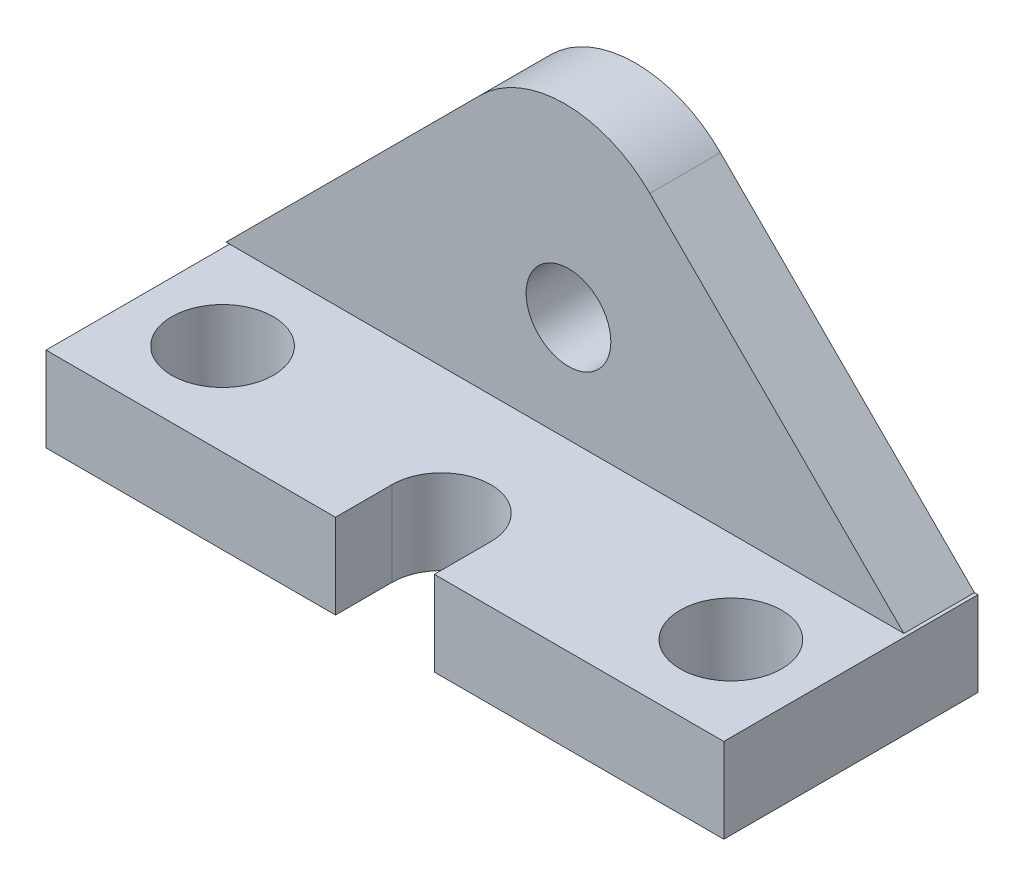
ISO-10303-21;
HEADER;
FILE_DESCRIPTION(('STEP AP214'),'2;1');
FILE_NAME('part.step','',(''),(''),'','','');
FILE_SCHEMA(('AUTOMOTIVE_DESIGN { 1 0 10303 214 1 1 1 1 }'));
ENDSEC;
DATA;
#1=APPLICATION_CONTEXT('core data for automotive mechanical design processes');
#2=APPLICATION_PROTOCOL_DEFINITION('international standard','automotive_design',2000,#1);
#3=PRODUCT_CONTEXT('',#1,'mechanical');
#4=PRODUCT('Part','Part','',(#3));
#5=PRODUCT_RELATED_PRODUCT_CATEGORY('part','',(#4));
#6=PRODUCT_DEFINITION_FORMATION('','',#4);
#7=PRODUCT_DEFINITION_CONTEXT('part definition',#1,'design');
#8=PRODUCT_DEFINITION('design','',#6,#7);
#9=PRODUCT_DEFINITION_SHAPE('','',#8);
#10=(LENGTH_UNIT() NAMED_UNIT(*) SI_UNIT(.MILLI.,.METRE.));
#11=(NAMED_UNIT(*) PLANE_ANGLE_UNIT() SI_UNIT($,.RADIAN.));
#12=(NAMED_UNIT(*) SI_UNIT($,.STERADIAN.) SOLID_ANGLE_UNIT());
#13=UNCERTAINTY_MEASURE_WITH_UNIT(LENGTH_MEASURE(1.E-05),#10,'distance_accuracy_value','');
#14=(GEOMETRIC_REPRESENTATION_CONTEXT(3) GLOBAL_UNCERTAINTY_ASSIGNED_CONTEXT((#13)) GLOBAL_UNIT_ASSIGNED_CONTEXT((#10,
#11,#12)) REPRESENTATION_CONTEXT('',''));
#15=CARTESIAN_POINT('',(0.,0.,0.));
#16=DIRECTION('',(0.,0.,1.));
#17=DIRECTION('',(1.,0.,0.));
#18=AXIS2_PLACEMENT_3D('',#15,#16,#17);
#19=CARTESIAN_POINT('',(48.,0.,31.));
#20=DIRECTION('',(0.,0.,-1.));
#21=DIRECTION('',(-1.,0.,0.));
#22=AXIS2_PLACEMENT_3D('',#19,#20,#21);
#23=PLANE('',#22);
#24=DIRECTION('',(-1.,0.,0.));
#25=VECTOR('',#24,1.);
#26=CARTESIAN_POINT('',(48.,0.,31.));
#27=LINE('',#26,#25);
#28=CARTESIAN_POINT('',(48.,0.,31.));
#29=VERTEX_POINT('',#28);
#30=CARTESIAN_POINT('',(7.,0.,31.));
#31=VERTEX_POINT('',#30);
#32=EDGE_CURVE('E168',#29,#31,#27,.T.);
#33=ORIENTED_EDGE('',*,*,#32,.T.);
#34=DIRECTION('',(0.,1.,0.));
#35=VECTOR('',#34,1.);
#36=CARTESIAN_POINT('',(7.,-48.,31.));
#37=LINE('',#36,#35);
#38=CARTESIAN_POINT('',(7.,-12.,31.));
#39=VERTEX_POINT('',#38);
#40=EDGE_CURVE('E151',#39,#31,#37,.T.);
#41=ORIENTED_EDGE('',*,*,#40,.F.);
#42=DIRECTION('',(-1.,0.,0.));
#43=VECTOR('',#42,1.);
#44=CARTESIAN_POINT('',(48.,-12.,31.));
#45=LINE('',#44,#43);
#46=CARTESIAN_POINT('',(48.,-12.,31.));
#47=VERTEX_POINT('',#46);
#48=EDGE_CURVE('E157',#47,#39,#45,.T.);
#49=ORIENTED_EDGE('',*,*,#48,.F.);
#50=DIRECTION('',(0.,-1.,0.));
#51=VECTOR('',#50,1.);
#52=CARTESIAN_POINT('',(48.,0.,31.));
#53=LINE('',#52,#51);
#54=EDGE_CURVE('E275',#29,#47,#53,.T.);
#55=ORIENTED_EDGE('',*,*,#54,.F.);
#56=EDGE_LOOP('',(#33,#41,#49,#55));
#57=FACE_BOUND('',#56,.T.);
#58=ADVANCED_FACE('F39',(#57),#23,.F.);
#59=CARTESIAN_POINT('',(-0.497409326424877,23.9583694396574,5.));
#60=DIRECTION('',(0.,0.,-1.));
#61=DIRECTION('',(-1.,0.,0.));
#62=AXIS2_PLACEMENT_3D('',#59,#60,#61);
#63=PLANE('',#62);
#64=DIRECTION('',(-0.707106781186548,-0.707106781186548,0.));
#65=VECTOR('',#64,1.);
#66=CARTESIAN_POINT('',(-48.4974093264249,0.,5.));
#67=LINE('',#66,#65);
#68=CARTESIAN_POINT('',(-12.5182246065962,35.9791847198287,5.));
#69=VERTEX_POINT('',#68);
#70=CARTESIAN_POINT('',(-48.4974093264249,0.,5.));
#71=VERTEX_POINT('',#70);
#72=EDGE_CURVE('E188',#69,#71,#67,.T.);
#73=ORIENTED_EDGE('',*,*,#72,.T.);
#74=DIRECTION('',(1.,0.,0.));
#75=VECTOR('',#74,1.);
#76=CARTESIAN_POINT('',(-48.4974093264249,0.,5.));
#77=LINE('',#76,#75);
#78=CARTESIAN_POINT('',(-48.,0.,5.));
#79=VERTEX_POINT('',#78);
#80=EDGE_CURVE('E194',#71,#79,#77,.T.);
#81=ORIENTED_EDGE('',*,*,#80,.T.);
#82=CARTESIAN_POINT('',(47.5025906735751,0.,5.));
#83=VERTEX_POINT('',#82);
#84=EDGE_CURVE('E192',#79,#83,#77,.T.);
#85=ORIENTED_EDGE('',*,*,#84,.T.);
#86=DIRECTION('',(-0.707106781186548,0.707106781186547,0.));
#87=VECTOR('',#86,1.);
#88=CARTESIAN_POINT('',(47.5025906735751,0.,5.));
#89=LINE('',#88,#87);
#90=CARTESIAN_POINT('',(11.5234059537464,35.9791847198287,5.));
#91=VERTEX_POINT('',#90);
#92=EDGE_CURVE('E198',#83,#91,#89,.T.);
#93=ORIENTED_EDGE('',*,*,#92,.T.);
#94=CARTESIAN_POINT('',(-0.497409326424877,23.9583694396574,5.));
#95=DIRECTION('',(0.,0.,1.));
#96=DIRECTION('',(-1.,0.,0.));
#97=AXIS2_PLACEMENT_3D('',#94,#95,#96);
#98=CIRCLE('',#97,17.);
#99=EDGE_CURVE('E201',#91,#69,#98,.T.);
#100=ORIENTED_EDGE('',*,*,#99,.T.);
#101=EDGE_LOOP('',(#73,#81,#85,#93,#100));
#102=FACE_BOUND('',#101,.T.);
#103=CARTESIAN_POINT('',(0.,15.,5.));
#104=DIRECTION('',(0.,0.,1.));
#105=DIRECTION('',(1.,0.,0.));
#106=AXIS2_PLACEMENT_3D('',#103,#104,#105);
#107=CIRCLE('',#106,6.);
#108=CARTESIAN_POINT('',(6.,15.,5.));
#109=VERTEX_POINT('',#108);
#110=EDGE_CURVE('E180',#109,#109,#107,.T.);
#111=ORIENTED_EDGE('',*,*,#110,.F.);
#112=EDGE_LOOP('',(#111));
#113=FACE_BOUND('',#112,.T.);
#114=ADVANCED_FACE('F307',(#102,#113),#63,.F.);
#115=CARTESIAN_POINT('',(-0.497409326424877,23.9583694396574,-5.));
#116=DIRECTION('',(0.,0.,-1.));
#117=DIRECTION('',(-1.,0.,0.));
#118=AXIS2_PLACEMENT_3D('',#115,#116,#117);
#119=PLANE('',#118);
#120=DIRECTION('',(-0.707106781186548,-0.707106781186548,0.));
#121=VECTOR('',#120,1.);
#122=CARTESIAN_POINT('',(-48.4974093264249,0.,-5.));
#123=LINE('',#122,#121);
#124=CARTESIAN_POINT('',(-12.5182246065962,35.9791847198287,-5.));
#125=VERTEX_POINT('',#124);
#126=CARTESIAN_POINT('',(-48.4974093264249,0.,-5.));
#127=VERTEX_POINT('',#126);
#128=EDGE_CURVE('E184',#125,#127,#123,.T.);
#129=ORIENTED_EDGE('',*,*,#128,.F.);
#130=CARTESIAN_POINT('',(-0.497409326424877,23.9583694396574,-5.));
#131=DIRECTION('',(0.,0.,1.));
#132=DIRECTION('',(-1.,0.,0.));
#133=AXIS2_PLACEMENT_3D('',#130,#131,#132);
#134=CIRCLE('',#133,17.);
#135=CARTESIAN_POINT('',(11.5234059537464,35.9791847198287,-5.));
#136=VERTEX_POINT('',#135);
#137=EDGE_CURVE('E193',#136,#125,#134,.T.);
#138=ORIENTED_EDGE('',*,*,#137,.F.);
#139=DIRECTION('',(-0.707106781186548,0.707106781186547,0.));
#140=VECTOR('',#139,1.);
#141=CARTESIAN_POINT('',(47.5025906735751,0.,-5.));
#142=LINE('',#141,#140);
#143=CARTESIAN_POINT('',(47.5025906735751,0.,-5.));
#144=VERTEX_POINT('',#143);
#145=EDGE_CURVE('E212',#144,#136,#142,.T.);
#146=ORIENTED_EDGE('',*,*,#145,.F.);
#147=DIRECTION('',(-1.,0.,0.));
#148=VECTOR('',#147,1.);
#149=CARTESIAN_POINT('',(48.,0.,-5.));
#150=LINE('',#149,#148);
#151=CARTESIAN_POINT('',(48.,0.,-5.));
#152=VERTEX_POINT('',#151);
#153=EDGE_CURVE('E176',#152,#144,#150,.T.);
#154=ORIENTED_EDGE('',*,*,#153,.F.);
#155=DIRECTION('',(0.,1.,0.));
#156=VECTOR('',#155,1.);
#157=CARTESIAN_POINT('',(48.,0.,-5.));
#158=LINE('',#157,#156);
#159=CARTESIAN_POINT('',(48.,-12.,-5.));
#160=VERTEX_POINT('',#159);
#161=EDGE_CURVE('E267',#160,#152,#158,.T.);
#162=ORIENTED_EDGE('',*,*,#161,.F.);
#163=DIRECTION('',(-1.,0.,0.));
#164=VECTOR('',#163,1.);
#165=CARTESIAN_POINT('',(48.,-12.,-5.));
#166=LINE('',#165,#164);
#167=CARTESIAN_POINT('',(-48.,-12.,-5.));
#168=VERTEX_POINT('',#167);
#169=EDGE_CURVE('E170',#160,#168,#166,.T.);
#170=ORIENTED_EDGE('',*,*,#169,.T.);
#171=DIRECTION('',(0.,1.,0.));
#172=VECTOR('',#171,1.);
#173=CARTESIAN_POINT('',(-48.,0.,-5.));
#174=LINE('',#173,#172);
#175=CARTESIAN_POINT('',(-48.,0.,-5.));
#176=VERTEX_POINT('',#175);
#177=EDGE_CURVE('E266',#168,#176,#174,.T.);
#178=ORIENTED_EDGE('',*,*,#177,.T.);
#179=DIRECTION('',(1.,0.,0.));
#180=VECTOR('',#179,1.);
#181=CARTESIAN_POINT('',(-48.4974093264249,0.,-5.));
#182=LINE('',#181,#180);
#183=EDGE_CURVE('E208',#127,#176,#182,.T.);
#184=ORIENTED_EDGE('',*,*,#183,.F.);
#185=EDGE_LOOP('',(#129,#138,#146,#154,#162,#170,#178,#184));
#186=FACE_BOUND('',#185,.T.);
#187=CARTESIAN_POINT('',(0.,15.,-5.));
#188=DIRECTION('',(0.,0.,1.));
#189=DIRECTION('',(1.,0.,0.));
#190=AXIS2_PLACEMENT_3D('',#187,#188,#189);
#191=CIRCLE('',#190,6.);
#192=CARTESIAN_POINT('',(6.,15.,-5.));
#193=VERTEX_POINT('',#192);
#194=EDGE_CURVE('E179',#193,#193,#191,.T.);
#195=ORIENTED_EDGE('',*,*,#194,.T.);
#196=EDGE_LOOP('',(#195));
#197=FACE_BOUND('',#196,.T.);
#198=ADVANCED_FACE('F298',(#186,#197),#119,.T.);
#199=CARTESIAN_POINT('',(-48.4974093264249,0.,5.));
#200=DIRECTION('',(0.707106781186548,-0.707106781186548,0.));
#201=DIRECTION('',(0.707106781186548,0.707106781186548,0.));
#202=AXIS2_PLACEMENT_3D('',#199,#200,#201);
#203=PLANE('',#202);
#204=ORIENTED_EDGE('',*,*,#128,.T.);
#205=DIRECTION('',(0.,0.,-1.));
#206=VECTOR('',#205,1.);
#207=CARTESIAN_POINT('',(-48.4974093264249,0.,5.));
#208=LINE('',#207,#206);
#209=EDGE_CURVE('E142',#71,#127,#208,.T.);
#210=ORIENTED_EDGE('',*,*,#209,.F.);
#211=ORIENTED_EDGE('',*,*,#72,.F.);
#212=DIRECTION('',(0.,0.,-1.));
#213=VECTOR('',#212,1.);
#214=CARTESIAN_POINT('',(-12.5182246065962,35.9791847198287,5.));
#215=LINE('',#214,#213);
#216=EDGE_CURVE('E204',#69,#125,#215,.T.);
#217=ORIENTED_EDGE('',*,*,#216,.T.);
#218=EDGE_LOOP('',(#204,#210,#211,#217));
#219=FACE_BOUND('',#218,.T.);
#220=ADVANCED_FACE('F41',(#219),#203,.F.);
#221=CARTESIAN_POINT('',(-48.4974093264249,0.,5.));
#222=DIRECTION('',(0.,1.,0.));
#223=DIRECTION('',(0.,0.,1.));
#224=AXIS2_PLACEMENT_3D('',#221,#222,#223);
#225=PLANE('',#224);
#226=ORIENTED_EDGE('',*,*,#183,.T.);
#227=DIRECTION('',(0.,0.,1.));
#228=VECTOR('',#227,1.);
#229=CARTESIAN_POINT('',(-48.,0.,-5.));
#230=LINE('',#229,#228);
#231=EDGE_CURVE('E283',#176,#79,#230,.T.);
#232=ORIENTED_EDGE('',*,*,#231,.T.);
#233=ORIENTED_EDGE('',*,*,#80,.F.);
#234=ORIENTED_EDGE('',*,*,#209,.T.);
#235=EDGE_LOOP('',(#226,#232,#233,#234));
#236=FACE_BOUND('',#235,.T.);
#237=ADVANCED_FACE('F304',(#236),#225,.F.);
#238=CARTESIAN_POINT('',(47.5025906735751,0.,5.));
#239=DIRECTION('',(-0.707106781186547,-0.707106781186548,0.));
#240=DIRECTION('',(0.707106781186548,-0.707106781186547,0.));
#241=AXIS2_PLACEMENT_3D('',#238,#239,#240);
#242=PLANE('',#241);
#243=ORIENTED_EDGE('',*,*,#145,.T.);
#244=DIRECTION('',(0.,0.,-1.));
#245=VECTOR('',#244,1.);
#246=CARTESIAN_POINT('',(11.5234059537464,35.9791847198287,5.));
#247=LINE('',#246,#245);
#248=EDGE_CURVE('E220',#91,#136,#247,.T.);
#249=ORIENTED_EDGE('',*,*,#248,.F.);
#250=ORIENTED_EDGE('',*,*,#92,.F.);
#251=DIRECTION('',(0.,0.,-1.));
#252=VECTOR('',#251,1.);
#253=CARTESIAN_POINT('',(47.5025906735751,0.,5.));
#254=LINE('',#253,#252);
#255=EDGE_CURVE('E224',#83,#144,#254,.T.);
#256=ORIENTED_EDGE('',*,*,#255,.T.);
#257=EDGE_LOOP('',(#243,#249,#250,#256));
#258=FACE_BOUND('',#257,.T.);
#259=ADVANCED_FACE('F321',(#258),#242,.F.);
#260=CARTESIAN_POINT('',(-0.497409326424877,23.9583694396574,5.));
#261=DIRECTION('',(0.,0.,-1.));
#262=DIRECTION('',(-1.,0.,0.));
#263=AXIS2_PLACEMENT_3D('',#260,#261,#262);
#264=CYLINDRICAL_SURFACE('',#263,17.);
#265=ORIENTED_EDGE('',*,*,#137,.T.);
#266=ORIENTED_EDGE('',*,*,#216,.F.);
#267=ORIENTED_EDGE('',*,*,#99,.F.);
#268=ORIENTED_EDGE('',*,*,#248,.T.);
#269=EDGE_LOOP('',(#265,#266,#267,#268));
#270=FACE_BOUND('',#269,.T.);
#271=ADVANCED_FACE('F318',(#270),#264,.T.);
#272=CARTESIAN_POINT('',(0.,15.,5.));
#273=DIRECTION('',(0.,0.,-1.));
#274=DIRECTION('',(-1.,0.,0.));
#275=AXIS2_PLACEMENT_3D('',#272,#273,#274);
#276=CYLINDRICAL_SURFACE('',#275,6.);
#277=ORIENTED_EDGE('',*,*,#110,.T.);
#278=EDGE_LOOP('',(#277));
#279=FACE_BOUND('',#278,.T.);
#280=ORIENTED_EDGE('',*,*,#194,.F.);
#281=EDGE_LOOP('',(#280));
#282=FACE_BOUND('',#281,.T.);
#283=ADVANCED_FACE('F341',(#279,#282),#276,.F.);
#284=CARTESIAN_POINT('',(48.,0.,-5.));
#285=DIRECTION('',(0.,-1.,0.));
#286=DIRECTION('',(0.,0.,-1.));
#287=AXIS2_PLACEMENT_3D('',#284,#285,#286);
#288=PLANE('',#287);
#289=CARTESIAN_POINT('',(36.,0.,18.));
#290=DIRECTION('',(0.,-1.,0.));
#291=DIRECTION('',(0.,0.,-1.));
#292=AXIS2_PLACEMENT_3D('',#289,#290,#291);
#293=CIRCLE('',#292,7.2);
#294=CARTESIAN_POINT('',(36.,0.,10.8));
#295=VERTEX_POINT('',#294);
#296=EDGE_CURVE('E236',#295,#295,#293,.T.);
#297=ORIENTED_EDGE('',*,*,#296,.T.);
#298=EDGE_LOOP('',(#297));
#299=FACE_BOUND('',#298,.T.);
#300=CARTESIAN_POINT('',(-36.,0.,18.));
#301=DIRECTION('',(0.,-1.,0.));
#302=DIRECTION('',(0.,0.,-1.));
#303=AXIS2_PLACEMENT_3D('',#300,#301,#302);
#304=CIRCLE('',#303,7.2);
#305=CARTESIAN_POINT('',(-36.,0.,10.8));
#306=VERTEX_POINT('',#305);
#307=EDGE_CURVE('E235',#306,#306,#304,.T.);
#308=ORIENTED_EDGE('',*,*,#307,.T.);
#309=EDGE_LOOP('',(#308));
#310=FACE_BOUND('',#309,.T.);
#311=CARTESIAN_POINT('',(0.,0.,23.));
#312=DIRECTION('',(0.,-1.,0.));
#313=DIRECTION('',(0.,0.,-1.));
#314=AXIS2_PLACEMENT_3D('',#311,#312,#313);
#315=CIRCLE('',#314,7.);
#316=CARTESIAN_POINT('',(-7.,0.,23.));
#317=VERTEX_POINT('',#316);
#318=CARTESIAN_POINT('',(7.,0.,23.));
#319=VERTEX_POINT('',#318);
#320=EDGE_CURVE('E150',#317,#319,#315,.T.);
#321=ORIENTED_EDGE('',*,*,#320,.T.);
#322=DIRECTION('',(0.,0.,1.));
#323=VECTOR('',#322,1.);
#324=CARTESIAN_POINT('',(6.99999999999999,0.,-4.99999999999999));
#325=LINE('',#324,#323);
#326=EDGE_CURVE('E148',#319,#31,#325,.T.);
#327=ORIENTED_EDGE('',*,*,#326,.T.);
#328=ORIENTED_EDGE('',*,*,#32,.F.);
#329=DIRECTION('',(0.,0.,1.));
#330=VECTOR('',#329,1.);
#331=CARTESIAN_POINT('',(48.,0.,-5.));
#332=LINE('',#331,#330);
#333=EDGE_CURVE('E271',#152,#29,#332,.T.);
#334=ORIENTED_EDGE('',*,*,#333,.F.);
#335=ORIENTED_EDGE('',*,*,#153,.T.);
#336=ORIENTED_EDGE('',*,*,#255,.F.);
#337=ORIENTED_EDGE('',*,*,#84,.F.);
#338=CARTESIAN_POINT('',(-48.,0.,31.));
#339=VERTEX_POINT('',#338);
#340=EDGE_CURVE('E65',#79,#339,#230,.T.);
#341=ORIENTED_EDGE('',*,*,#340,.T.);
#342=CARTESIAN_POINT('',(-7.,0.,31.));
#343=VERTEX_POINT('',#342);
#344=EDGE_CURVE('E163',#343,#339,#27,.T.);
#345=ORIENTED_EDGE('',*,*,#344,.F.);
#346=DIRECTION('',(0.,0.,-1.));
#347=VECTOR('',#346,1.);
#348=CARTESIAN_POINT('',(-7.,0.,-4.99999999999999));
#349=LINE('',#348,#347);
#350=EDGE_CURVE('E260',#343,#317,#349,.T.);
#351=ORIENTED_EDGE('',*,*,#350,.T.);
#352=EDGE_LOOP('',(#321,#327,#328,#334,#335,#336,#337,#341,#345,#351));
#353=FACE_BOUND('',#352,.T.);
#354=ADVANCED_FACE('F323',(#299,#310,#353),#288,.F.);
#355=CARTESIAN_POINT('',(-7.,-12.,31.));
#356=VERTEX_POINT('',#355);
#357=CARTESIAN_POINT('',(-48.,-12.,31.));
#358=VERTEX_POINT('',#357);
#359=EDGE_CURVE('E164',#356,#358,#45,.T.);
#360=ORIENTED_EDGE('',*,*,#359,.F.);
#361=DIRECTION('',(0.,1.,0.));
#362=VECTOR('',#361,1.);
#363=CARTESIAN_POINT('',(-7.,-48.,31.));
#364=LINE('',#363,#362);
#365=EDGE_CURVE('E252',#356,#343,#364,.T.);
#366=ORIENTED_EDGE('',*,*,#365,.T.);
#367=ORIENTED_EDGE('',*,*,#344,.T.);
#368=DIRECTION('',(0.,-1.,0.));
#369=VECTOR('',#368,1.);
#370=CARTESIAN_POINT('',(-48.,0.,31.));
#371=LINE('',#370,#369);
#372=EDGE_CURVE('E287',#339,#358,#371,.T.);
#373=ORIENTED_EDGE('',*,*,#372,.T.);
#374=EDGE_LOOP('',(#360,#366,#367,#373));
#375=FACE_BOUND('',#374,.T.);
#376=ADVANCED_FACE('F331',(#375),#23,.F.);
#377=CARTESIAN_POINT('',(48.,-12.,-5.));
#378=DIRECTION('',(0.,1.,0.));
#379=DIRECTION('',(0.,0.,1.));
#380=AXIS2_PLACEMENT_3D('',#377,#378,#379);
#381=PLANE('',#380);
#382=CARTESIAN_POINT('',(36.,-12.,18.));
#383=DIRECTION('',(0.,1.,0.));
#384=DIRECTION('',(0.,0.,1.));
#385=AXIS2_PLACEMENT_3D('',#382,#383,#384);
#386=CIRCLE('',#385,7.2);
#387=CARTESIAN_POINT('',(36.,-12.,25.2));
#388=VERTEX_POINT('',#387);
#389=EDGE_CURVE('E43',#388,#388,#386,.T.);
#390=ORIENTED_EDGE('',*,*,#389,.T.);
#391=EDGE_LOOP('',(#390));
#392=FACE_BOUND('',#391,.T.);
#393=CARTESIAN_POINT('',(-36.,-12.,18.));
#394=DIRECTION('',(0.,1.,0.));
#395=DIRECTION('',(0.,0.,1.));
#396=AXIS2_PLACEMENT_3D('',#393,#394,#395);
#397=CIRCLE('',#396,7.2);
#398=CARTESIAN_POINT('',(-36.,-12.,25.2));
#399=VERTEX_POINT('',#398);
#400=EDGE_CURVE('E232',#399,#399,#397,.T.);
#401=ORIENTED_EDGE('',*,*,#400,.T.);
#402=EDGE_LOOP('',(#401));
#403=FACE_BOUND('',#402,.T.);
#404=ORIENTED_EDGE('',*,*,#48,.T.);
#405=DIRECTION('',(0.,0.,-1.));
#406=VECTOR('',#405,1.);
#407=CARTESIAN_POINT('',(6.99999999999999,-12.,-4.99999999999999));
#408=LINE('',#407,#406);
#409=CARTESIAN_POINT('',(7.,-12.,23.));
#410=VERTEX_POINT('',#409);
#411=EDGE_CURVE('E11',#39,#410,#408,.T.);
#412=ORIENTED_EDGE('',*,*,#411,.T.);
#413=CARTESIAN_POINT('',(0.,-12.,23.));
#414=DIRECTION('',(0.,1.,0.));
#415=DIRECTION('',(0.,0.,1.));
#416=AXIS2_PLACEMENT_3D('',#413,#414,#415);
#417=CIRCLE('',#416,7.);
#418=CARTESIAN_POINT('',(-7.,-12.,23.));
#419=VERTEX_POINT('',#418);
#420=EDGE_CURVE('E134',#410,#419,#417,.T.);
#421=ORIENTED_EDGE('',*,*,#420,.T.);
#422=DIRECTION('',(0.,0.,1.));
#423=VECTOR('',#422,1.);
#424=CARTESIAN_POINT('',(-7.,-12.,-4.99999999999999));
#425=LINE('',#424,#423);
#426=EDGE_CURVE('E49',#419,#356,#425,.T.);
#427=ORIENTED_EDGE('',*,*,#426,.T.);
#428=ORIENTED_EDGE('',*,*,#359,.T.);
#429=DIRECTION('',(0.,0.,-1.));
#430=VECTOR('',#429,1.);
#431=CARTESIAN_POINT('',(-48.,-12.,-5.));
#432=LINE('',#431,#430);
#433=EDGE_CURVE('E272',#358,#168,#432,.T.);
#434=ORIENTED_EDGE('',*,*,#433,.T.);
#435=ORIENTED_EDGE('',*,*,#169,.F.);
#436=DIRECTION('',(0.,0.,-1.));
#437=VECTOR('',#436,1.);
#438=CARTESIAN_POINT('',(48.,-12.,-5.));
#439=LINE('',#438,#437);
#440=EDGE_CURVE('E159',#47,#160,#439,.T.);
#441=ORIENTED_EDGE('',*,*,#440,.F.);
#442=EDGE_LOOP('',(#404,#412,#421,#427,#428,#434,#435,#441));
#443=FACE_BOUND('',#442,.T.);
#444=ADVANCED_FACE('F154',(#392,#403,#443),#381,.F.);
#445=CARTESIAN_POINT('',(48.,0.,0.));
#446=DIRECTION('',(-1.,0.,0.));
#447=DIRECTION('',(0.,0.,1.));
#448=AXIS2_PLACEMENT_3D('',#445,#446,#447);
#449=PLANE('',#448);
#450=ORIENTED_EDGE('',*,*,#161,.T.);
#451=ORIENTED_EDGE('',*,*,#333,.T.);
#452=ORIENTED_EDGE('',*,*,#54,.T.);
#453=ORIENTED_EDGE('',*,*,#440,.T.);
#454=EDGE_LOOP('',(#450,#451,#452,#453));
#455=FACE_BOUND('',#454,.T.);
#456=ADVANCED_FACE('F326',(#455),#449,.F.);
#457=CARTESIAN_POINT('',(-48.,0.,0.));
#458=DIRECTION('',(-1.,0.,0.));
#459=DIRECTION('',(0.,0.,1.));
#460=AXIS2_PLACEMENT_3D('',#457,#458,#459);
#461=PLANE('',#460);
#462=ORIENTED_EDGE('',*,*,#177,.F.);
#463=ORIENTED_EDGE('',*,*,#433,.F.);
#464=ORIENTED_EDGE('',*,*,#372,.F.);
#465=ORIENTED_EDGE('',*,*,#340,.F.);
#466=ORIENTED_EDGE('',*,*,#231,.F.);
#467=EDGE_LOOP('',(#462,#463,#464,#465,#466));
#468=FACE_BOUND('',#467,.T.);
#469=ADVANCED_FACE('F302',(#468),#461,.T.);
#470=CARTESIAN_POINT('',(7.,-48.,31.));
#471=DIRECTION('',(1.,0.,0.));
#472=DIRECTION('',(0.,0.,-1.));
#473=AXIS2_PLACEMENT_3D('',#470,#471,#472);
#474=PLANE('',#473);
#475=DIRECTION('',(0.,1.,0.));
#476=VECTOR('',#475,1.);
#477=CARTESIAN_POINT('',(7.,-48.,23.));
#478=LINE('',#477,#476);
#479=EDGE_CURVE('E137',#410,#319,#478,.T.);
#480=ORIENTED_EDGE('',*,*,#479,.F.);
#481=ORIENTED_EDGE('',*,*,#411,.F.);
#482=ORIENTED_EDGE('',*,*,#40,.T.);
#483=ORIENTED_EDGE('',*,*,#326,.F.);
#484=EDGE_LOOP('',(#480,#481,#482,#483));
#485=FACE_BOUND('',#484,.T.);
#486=ADVANCED_FACE('F145',(#485),#474,.F.);
#487=CARTESIAN_POINT('',(-7.,-48.,23.));
#488=DIRECTION('',(-1.,0.,0.));
#489=DIRECTION('',(0.,0.,1.));
#490=AXIS2_PLACEMENT_3D('',#487,#488,#489);
#491=PLANE('',#490);
#492=ORIENTED_EDGE('',*,*,#365,.F.);
#493=ORIENTED_EDGE('',*,*,#426,.F.);
#494=DIRECTION('',(0.,1.,0.));
#495=VECTOR('',#494,1.);
#496=CARTESIAN_POINT('',(-7.,-48.,23.));
#497=LINE('',#496,#495);
#498=EDGE_CURVE('E57',#419,#317,#497,.T.);
#499=ORIENTED_EDGE('',*,*,#498,.T.);
#500=ORIENTED_EDGE('',*,*,#350,.F.);
#501=EDGE_LOOP('',(#492,#493,#499,#500));
#502=FACE_BOUND('',#501,.T.);
#503=ADVANCED_FACE('F329',(#502),#491,.F.);
#504=CARTESIAN_POINT('',(0.,-48.,23.));
#505=DIRECTION('',(0.,1.,0.));
#506=DIRECTION('',(0.,0.,1.));
#507=AXIS2_PLACEMENT_3D('',#504,#505,#506);
#508=CYLINDRICAL_SURFACE('',#507,7.);
#509=ORIENTED_EDGE('',*,*,#498,.F.);
#510=ORIENTED_EDGE('',*,*,#420,.F.);
#511=ORIENTED_EDGE('',*,*,#479,.T.);
#512=ORIENTED_EDGE('',*,*,#320,.F.);
#513=EDGE_LOOP('',(#509,#510,#511,#512));
#514=FACE_BOUND('',#513,.T.);
#515=ADVANCED_FACE('F136',(#514),#508,.F.);
#516=CARTESIAN_POINT('',(-36.,-48.,18.));
#517=DIRECTION('',(0.,1.,0.));
#518=DIRECTION('',(0.,0.,1.));
#519=AXIS2_PLACEMENT_3D('',#516,#517,#518);
#520=CYLINDRICAL_SURFACE('',#519,7.2);
#521=ORIENTED_EDGE('',*,*,#400,.F.);
#522=EDGE_LOOP('',(#521));
#523=FACE_BOUND('',#522,.T.);
#524=ORIENTED_EDGE('',*,*,#307,.F.);
#525=EDGE_LOOP('',(#524));
#526=FACE_BOUND('',#525,.T.);
#527=ADVANCED_FACE('F436',(#523,#526),#520,.F.);
#528=CARTESIAN_POINT('',(36.,-48.,18.));
#529=DIRECTION('',(0.,1.,0.));
#530=DIRECTION('',(0.,0.,1.));
#531=AXIS2_PLACEMENT_3D('',#528,#529,#530);
#532=CYLINDRICAL_SURFACE('',#531,7.2);
#533=ORIENTED_EDGE('',*,*,#389,.F.);
#534=EDGE_LOOP('',(#533));
#535=FACE_BOUND('',#534,.T.);
#536=ORIENTED_EDGE('',*,*,#296,.F.);
#537=EDGE_LOOP('',(#536));
#538=FACE_BOUND('',#537,.T.);
#539=ADVANCED_FACE('F445',(#535,#538),#532,.F.);
#540=CLOSED_SHELL('',(#58,#114,#198,#220,#237,#259,#271,#283,#354,#376,#444,#456,#469,#486,#503,
#515,#527,#539));
#541=MANIFOLD_SOLID_BREP('B2',#540);
#542=ADVANCED_BREP_SHAPE_REPRESENTATION('',(#18,#541),#14);
#543=SHAPE_DEFINITION_REPRESENTATION(#9,#542);
ENDSEC;
END-ISO-10303-21;
